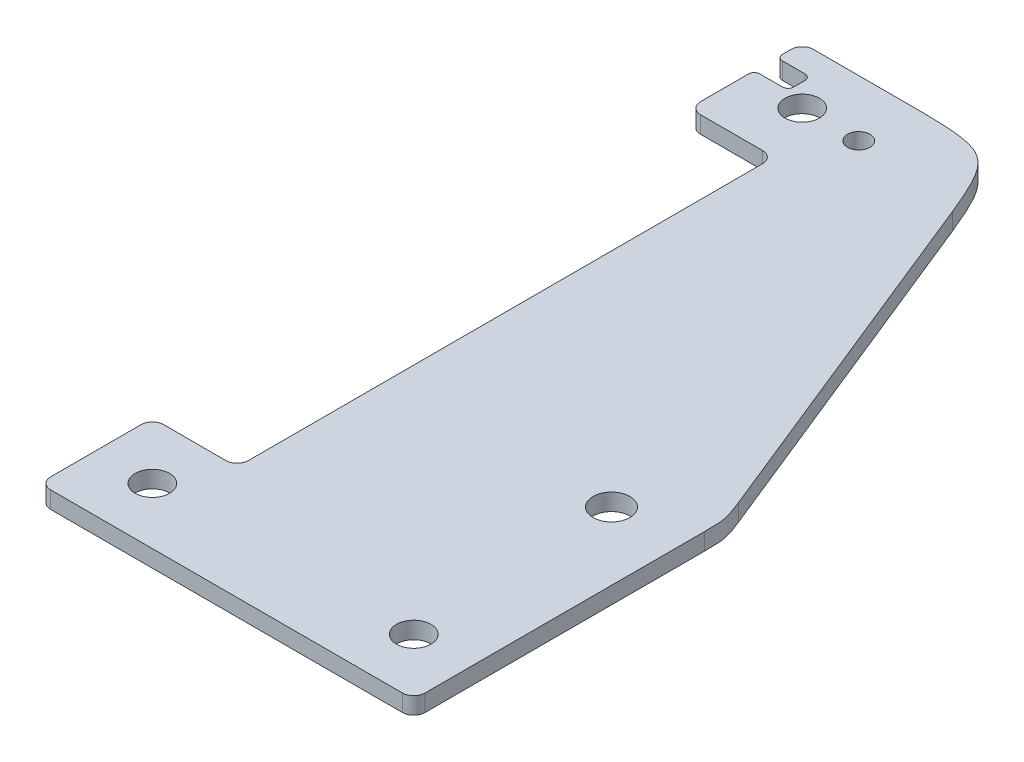
ISO-10303-21;
HEADER;
FILE_DESCRIPTION(('STEP AP214'),'2;1');
FILE_NAME('part.step','',(''),(''),'','','');
FILE_SCHEMA(('AUTOMOTIVE_DESIGN { 1 0 10303 214 1 1 1 1 }'));
ENDSEC;
DATA;
#1=APPLICATION_CONTEXT('core data for automotive mechanical design processes');
#2=APPLICATION_PROTOCOL_DEFINITION('international standard','automotive_design',2000,#1);
#3=PRODUCT_CONTEXT('',#1,'mechanical');
#4=PRODUCT('Part','Part','',(#3));
#5=PRODUCT_RELATED_PRODUCT_CATEGORY('part','',(#4));
#6=PRODUCT_DEFINITION_FORMATION('','',#4);
#7=PRODUCT_DEFINITION_CONTEXT('part definition',#1,'design');
#8=PRODUCT_DEFINITION('design','',#6,#7);
#9=PRODUCT_DEFINITION_SHAPE('','',#8);
#10=(LENGTH_UNIT() NAMED_UNIT(*) SI_UNIT(.MILLI.,.METRE.));
#11=(NAMED_UNIT(*) PLANE_ANGLE_UNIT() SI_UNIT($,.RADIAN.));
#12=(NAMED_UNIT(*) SI_UNIT($,.STERADIAN.) SOLID_ANGLE_UNIT());
#13=UNCERTAINTY_MEASURE_WITH_UNIT(LENGTH_MEASURE(1.E-05),#10,'distance_accuracy_value','');
#14=(GEOMETRIC_REPRESENTATION_CONTEXT(3) GLOBAL_UNCERTAINTY_ASSIGNED_CONTEXT((#13)) GLOBAL_UNIT_ASSIGNED_CONTEXT((#10,
#11,#12)) REPRESENTATION_CONTEXT('',''));
#15=CARTESIAN_POINT('',(0.,0.,0.));
#16=DIRECTION('',(0.,0.,1.));
#17=DIRECTION('',(1.,0.,0.));
#18=AXIS2_PLACEMENT_3D('',#15,#16,#17);
#19=CARTESIAN_POINT('',(0.,3.,0.));
#20=DIRECTION('',(0.,-1.,0.));
#21=DIRECTION('',(0.,0.,-1.));
#22=AXIS2_PLACEMENT_3D('',#19,#20,#21);
#23=PLANE('',#22);
#24=CARTESIAN_POINT('',(0.,3.,-57.5));
#25=DIRECTION('',(0.,1.,0.));
#26=DIRECTION('',(0.,0.,1.));
#27=AXIS2_PLACEMENT_3D('',#24,#25,#26);
#28=CIRCLE('',#27,2.);
#29=CARTESIAN_POINT('',(0.,3.,-55.5));
#30=VERTEX_POINT('',#29);
#31=EDGE_CURVE('E893',#30,#30,#28,.T.);
#32=ORIENTED_EDGE('',*,*,#31,.F.);
#33=EDGE_LOOP('',(#32));
#34=FACE_BOUND('',#33,.T.);
#35=CARTESIAN_POINT('',(34.25,3.,20.5));
#36=DIRECTION('',(0.,1.,0.));
#37=DIRECTION('',(-1.,0.,0.));
#38=AXIS2_PLACEMENT_3D('',#35,#36,#37);
#39=CIRCLE('',#38,3.25);
#40=CARTESIAN_POINT('',(31.,3.,20.5));
#41=VERTEX_POINT('',#40);
#42=EDGE_CURVE('E692',#41,#41,#39,.T.);
#43=ORIENTED_EDGE('',*,*,#42,.F.);
#44=EDGE_LOOP('',(#43));
#45=FACE_BOUND('',#44,.T.);
#46=CARTESIAN_POINT('',(36.25,3.,57.5));
#47=DIRECTION('',(0.,-1.,0.));
#48=DIRECTION('',(1.,0.,0.));
#49=AXIS2_PLACEMENT_3D('',#46,#47,#48);
#50=CIRCLE('',#49,3.05);
#51=CARTESIAN_POINT('',(39.3,3.,57.5));
#52=VERTEX_POINT('',#51);
#53=EDGE_CURVE('E498',#52,#52,#50,.T.);
#54=ORIENTED_EDGE('',*,*,#53,.T.);
#55=EDGE_LOOP('',(#54));
#56=FACE_BOUND('',#55,.T.);
#57=CARTESIAN_POINT('',(-10.,3.,-57.5));
#58=DIRECTION('',(0.,1.,0.));
#59=DIRECTION('',(1.,0.,0.));
#60=AXIS2_PLACEMENT_3D('',#57,#58,#59);
#61=CIRCLE('',#60,3.05);
#62=CARTESIAN_POINT('',(-6.95,3.,-57.5));
#63=VERTEX_POINT('',#62);
#64=EDGE_CURVE('E305',#63,#63,#61,.T.);
#65=ORIENTED_EDGE('',*,*,#64,.F.);
#66=EDGE_LOOP('',(#65));
#67=FACE_BOUND('',#66,.T.);
#68=CARTESIAN_POINT('',(-10.,3.,57.5));
#69=DIRECTION('',(0.,1.,0.));
#70=DIRECTION('',(1.,0.,0.));
#71=AXIS2_PLACEMENT_3D('',#68,#69,#70);
#72=CIRCLE('',#71,3.05);
#73=CARTESIAN_POINT('',(-6.95,3.,57.5));
#74=VERTEX_POINT('',#73);
#75=EDGE_CURVE('E321',#74,#74,#72,.T.);
#76=ORIENTED_EDGE('',*,*,#75,.F.);
#77=EDGE_LOOP('',(#76));
#78=FACE_BOUND('',#77,.T.);
#79=DIRECTION('',(0.374606593415918,0.,0.927183854566785));
#80=VECTOR('',#79,1.);
#81=CARTESIAN_POINT('',(35.5379010640419,3.,-14.3582440410083));
#82=LINE('',#81,#80);
#83=CARTESIAN_POINT('',(44.7936770913357,3.,8.55060552231191));
#84=VERTEX_POINT('',#83);
#85=CARTESIAN_POINT('',(19.1207447241643,3.,-54.9921318683184));
#86=VERTEX_POINT('',#85);
#87=EDGE_CURVE('E495',#84,#86,#82,.F.);
#88=ORIENTED_EDGE('',*,*,#87,.T.);
#89=CARTESIAN_POINT('',(0.577067632828641,3.,-67.5));
#90=CARTESIAN_POINT('',(14.0672379696771,3.,-67.5));
#91=CARTESIAN_POINT('',(19.1207447241643,3.,-54.9921318683184));
#92=(BOUNDED_CURVE() B_SPLINE_CURVE(2,(#89,#90,#91),.UNSPECIFIED.,.F.,
.F.) B_SPLINE_CURVE_WITH_KNOTS((3,3),(0.,1.),
.UNSPECIFIED.) CURVE() GEOMETRIC_REPRESENTATION_ITEM() RATIONAL_B_SPLINE_CURVE((1.,
2.33333333333333,1.)) REPRESENTATION_ITEM(''));
#93=CARTESIAN_POINT('',(0.577067632828641,3.,-67.5));
#94=VERTEX_POINT('',#93);
#95=EDGE_CURVE('E406',#86,#94,#92,.F.);
#96=ORIENTED_EDGE('',*,*,#95,.T.);
#97=DIRECTION('',(1.,0.,0.));
#98=VECTOR('',#97,1.);
#99=CARTESIAN_POINT('',(-20.,3.,-67.5));
#100=LINE('',#99,#98);
#101=CARTESIAN_POINT('',(-18.,3.,-67.5));
#102=VERTEX_POINT('',#101);
#103=EDGE_CURVE('E530',#102,#94,#100,.T.);
#104=ORIENTED_EDGE('',*,*,#103,.F.);
#105=CARTESIAN_POINT('',(-18.,3.,-65.5));
#106=DIRECTION('',(0.,1.,0.));
#107=DIRECTION('',(0.,0.,-1.));
#108=AXIS2_PLACEMENT_3D('',#105,#106,#107);
#109=CIRCLE('',#108,2.);
#110=CARTESIAN_POINT('',(-20.,3.,-65.5));
#111=VERTEX_POINT('',#110);
#112=EDGE_CURVE('E681',#102,#111,#109,.T.);
#113=ORIENTED_EDGE('',*,*,#112,.T.);
#114=DIRECTION('',(0.,0.,-1.));
#115=VECTOR('',#114,1.);
#116=CARTESIAN_POINT('',(-20.,3.,-47.5));
#117=LINE('',#116,#115);
#118=CARTESIAN_POINT('',(-20.,3.,-64.));
#119=VERTEX_POINT('',#118);
#120=EDGE_CURVE('E613',#119,#111,#117,.T.);
#121=ORIENTED_EDGE('',*,*,#120,.F.);
#122=CARTESIAN_POINT('',(-19.,3.,-64.));
#123=DIRECTION('',(0.,1.,0.));
#124=DIRECTION('',(-1.,0.,0.));
#125=AXIS2_PLACEMENT_3D('',#122,#123,#124);
#126=CIRCLE('',#125,1.);
#127=CARTESIAN_POINT('',(-19.,3.,-63.));
#128=VERTEX_POINT('',#127);
#129=EDGE_CURVE('E612',#119,#128,#126,.T.);
#130=ORIENTED_EDGE('',*,*,#129,.T.);
#131=DIRECTION('',(1.,0.,0.));
#132=VECTOR('',#131,1.);
#133=CARTESIAN_POINT('',(-19.,3.,-63.));
#134=LINE('',#133,#132);
#135=CARTESIAN_POINT('',(-15.,3.,-63.));
#136=VERTEX_POINT('',#135);
#137=EDGE_CURVE('E274',#128,#136,#134,.T.);
#138=ORIENTED_EDGE('',*,*,#137,.T.);
#139=CARTESIAN_POINT('',(-15.,3.,-62.));
#140=DIRECTION('',(0.,-1.,0.));
#141=DIRECTION('',(-1.,0.,0.));
#142=AXIS2_PLACEMENT_3D('',#139,#140,#141);
#143=CIRCLE('',#142,1.);
#144=CARTESIAN_POINT('',(-14.,3.,-62.));
#145=VERTEX_POINT('',#144);
#146=EDGE_CURVE('E268',#136,#145,#143,.T.);
#147=ORIENTED_EDGE('',*,*,#146,.T.);
#148=DIRECTION('',(0.,0.,1.));
#149=VECTOR('',#148,1.);
#150=CARTESIAN_POINT('',(-14.,3.,-62.));
#151=LINE('',#150,#149);
#152=CARTESIAN_POINT('',(-14.,3.,-60.));
#153=VERTEX_POINT('',#152);
#154=EDGE_CURVE('E258',#145,#153,#151,.T.);
#155=ORIENTED_EDGE('',*,*,#154,.T.);
#156=CARTESIAN_POINT('',(-15.,3.,-60.));
#157=DIRECTION('',(0.,-1.,0.));
#158=DIRECTION('',(-1.,0.,0.));
#159=AXIS2_PLACEMENT_3D('',#156,#157,#158);
#160=CIRCLE('',#159,1.);
#161=CARTESIAN_POINT('',(-15.,3.,-59.));
#162=VERTEX_POINT('',#161);
#163=EDGE_CURVE('E269',#153,#162,#160,.T.);
#164=ORIENTED_EDGE('',*,*,#163,.T.);
#165=DIRECTION('',(-1.,0.,0.));
#166=VECTOR('',#165,1.);
#167=CARTESIAN_POINT('',(-15.,3.,-59.));
#168=LINE('',#167,#166);
#169=CARTESIAN_POINT('',(-19.,3.,-59.));
#170=VERTEX_POINT('',#169);
#171=EDGE_CURVE('E630',#162,#170,#168,.T.);
#172=ORIENTED_EDGE('',*,*,#171,.T.);
#173=CARTESIAN_POINT('',(-19.,3.,-58.));
#174=DIRECTION('',(0.,1.,0.));
#175=DIRECTION('',(1.,0.,0.));
#176=AXIS2_PLACEMENT_3D('',#173,#174,#175);
#177=CIRCLE('',#176,1.);
#178=CARTESIAN_POINT('',(-20.,3.,-58.));
#179=VERTEX_POINT('',#178);
#180=EDGE_CURVE('E699',#170,#179,#177,.T.);
#181=ORIENTED_EDGE('',*,*,#180,.T.);
#182=DIRECTION('',(0.,0.,-1.));
#183=VECTOR('',#182,1.);
#184=CARTESIAN_POINT('',(-20.,3.,-47.5));
#185=LINE('',#184,#183);
#186=CARTESIAN_POINT('',(-20.,3.,-49.5));
#187=VERTEX_POINT('',#186);
#188=EDGE_CURVE('E533',#187,#179,#185,.T.);
#189=ORIENTED_EDGE('',*,*,#188,.F.);
#190=CARTESIAN_POINT('',(-18.,3.,-49.5));
#191=DIRECTION('',(0.,1.,0.));
#192=DIRECTION('',(0.,0.,-1.));
#193=AXIS2_PLACEMENT_3D('',#190,#191,#192);
#194=CIRCLE('',#193,2.);
#195=CARTESIAN_POINT('',(-18.,3.,-47.5));
#196=VERTEX_POINT('',#195);
#197=EDGE_CURVE('E736',#187,#196,#194,.T.);
#198=ORIENTED_EDGE('',*,*,#197,.T.);
#199=DIRECTION('',(-1.,0.,0.));
#200=VECTOR('',#199,1.);
#201=CARTESIAN_POINT('',(0.,3.,-47.5));
#202=LINE('',#201,#200);
#203=CARTESIAN_POINT('',(-7.,3.,-47.5));
#204=VERTEX_POINT('',#203);
#205=EDGE_CURVE('E760',#204,#196,#202,.T.);
#206=ORIENTED_EDGE('',*,*,#205,.F.);
#207=CARTESIAN_POINT('',(-7.,3.,-45.5));
#208=DIRECTION('',(0.,-1.,0.));
#209=DIRECTION('',(0.,0.,-1.));
#210=AXIS2_PLACEMENT_3D('',#207,#208,#209);
#211=CIRCLE('',#210,2.);
#212=CARTESIAN_POINT('',(-5.,3.,-45.5));
#213=VERTEX_POINT('',#212);
#214=EDGE_CURVE('E742',#204,#213,#211,.T.);
#215=ORIENTED_EDGE('',*,*,#214,.T.);
#216=DIRECTION('',(0.,0.,1.));
#217=VECTOR('',#216,1.);
#218=CARTESIAN_POINT('',(-5.,3.,-57.7596620908131));
#219=LINE('',#218,#217);
#220=CARTESIAN_POINT('',(-5.,3.,45.5));
#221=VERTEX_POINT('',#220);
#222=EDGE_CURVE('E801',#213,#221,#219,.T.);
#223=ORIENTED_EDGE('',*,*,#222,.T.);
#224=CARTESIAN_POINT('',(-7.,3.,45.5));
#225=DIRECTION('',(0.,-1.,0.));
#226=DIRECTION('',(0.,0.,-1.));
#227=AXIS2_PLACEMENT_3D('',#224,#225,#226);
#228=CIRCLE('',#227,2.);
#229=CARTESIAN_POINT('',(-7.,3.,47.5));
#230=VERTEX_POINT('',#229);
#231=EDGE_CURVE('E334',#221,#230,#228,.T.);
#232=ORIENTED_EDGE('',*,*,#231,.T.);
#233=DIRECTION('',(1.,0.,0.));
#234=VECTOR('',#233,1.);
#235=CARTESIAN_POINT('',(-20.,3.,47.5));
#236=LINE('',#235,#234);
#237=CARTESIAN_POINT('',(-18.,3.,47.5));
#238=VERTEX_POINT('',#237);
#239=EDGE_CURVE('E297',#238,#230,#236,.T.);
#240=ORIENTED_EDGE('',*,*,#239,.F.);
#241=CARTESIAN_POINT('',(-18.,3.,49.5));
#242=DIRECTION('',(0.,1.,0.));
#243=DIRECTION('',(0.,0.,-1.));
#244=AXIS2_PLACEMENT_3D('',#241,#242,#243);
#245=CIRCLE('',#244,2.);
#246=CARTESIAN_POINT('',(-20.,3.,49.5));
#247=VERTEX_POINT('',#246);
#248=EDGE_CURVE('E652',#238,#247,#245,.T.);
#249=ORIENTED_EDGE('',*,*,#248,.T.);
#250=DIRECTION('',(0.,0.,-1.));
#251=VECTOR('',#250,1.);
#252=CARTESIAN_POINT('',(-20.,3.,67.5));
#253=LINE('',#252,#251);
#254=CARTESIAN_POINT('',(-20.,3.,65.5));
#255=VERTEX_POINT('',#254);
#256=EDGE_CURVE('E510',#255,#247,#253,.T.);
#257=ORIENTED_EDGE('',*,*,#256,.F.);
#258=CARTESIAN_POINT('',(-18.,3.,65.5));
#259=DIRECTION('',(0.,1.,0.));
#260=DIRECTION('',(0.,0.,-1.));
#261=AXIS2_PLACEMENT_3D('',#258,#259,#260);
#262=CIRCLE('',#261,2.);
#263=CARTESIAN_POINT('',(-18.,3.,67.5));
#264=VERTEX_POINT('',#263);
#265=EDGE_CURVE('E647',#255,#264,#262,.T.);
#266=ORIENTED_EDGE('',*,*,#265,.T.);
#267=DIRECTION('',(-1.,0.,0.));
#268=VECTOR('',#267,1.);
#269=CARTESIAN_POINT('',(76.25,3.,67.5));
#270=LINE('',#269,#268);
#271=CARTESIAN_POINT('',(44.25,3.,67.5));
#272=VERTEX_POINT('',#271);
#273=EDGE_CURVE('E662',#272,#264,#270,.T.);
#274=ORIENTED_EDGE('',*,*,#273,.F.);
#275=CARTESIAN_POINT('',(44.25,3.,65.5));
#276=DIRECTION('',(0.,1.,0.));
#277=DIRECTION('',(0.,0.,-1.));
#278=AXIS2_PLACEMENT_3D('',#275,#276,#277);
#279=CIRCLE('',#278,2.);
#280=CARTESIAN_POINT('',(46.25,3.,65.5));
#281=VERTEX_POINT('',#280);
#282=EDGE_CURVE('E518',#272,#281,#279,.T.);
#283=ORIENTED_EDGE('',*,*,#282,.T.);
#284=DIRECTION('',(0.,0.,1.));
#285=VECTOR('',#284,1.);
#286=CARTESIAN_POINT('',(46.25,3.,67.5));
#287=LINE('',#286,#285);
#288=CARTESIAN_POINT('',(46.25,3.,16.0427373906303));
#289=VERTEX_POINT('',#288);
#290=EDGE_CURVE('E521',#289,#281,#287,.T.);
#291=ORIENTED_EDGE('',*,*,#290,.F.);
#292=CARTESIAN_POINT('',(44.7936770913357,3.,8.5506055223119));
#293=CARTESIAN_POINT('',(46.25,3.,12.1551312078758));
#294=CARTESIAN_POINT('',(46.25,3.,16.0427373906303));
#295=(BOUNDED_CURVE() B_SPLINE_CURVE(2,(#292,#293,#294),.UNSPECIFIED.,.F.,
.F.) B_SPLINE_CURVE_WITH_KNOTS((3,3),(0.,1.),
.UNSPECIFIED.) CURVE() GEOMETRIC_REPRESENTATION_ITEM() RATIONAL_B_SPLINE_CURVE((1.,
2.33333333333333,1.)) REPRESENTATION_ITEM(''));
#296=EDGE_CURVE('E462',#289,#84,#295,.F.);
#297=ORIENTED_EDGE('',*,*,#296,.T.);
#298=EDGE_LOOP('',(#88,#96,#104,#113,#121,#130,#138,#147,#155,#164,#172,#181,#189,#198,#206,
#215,#223,#232,#240,#249,#257,#266,#274,#283,#291,#297));
#299=FACE_BOUND('',#298,.T.);
#300=ADVANCED_FACE('F50',(#34,#45,#56,#67,#78,#299),#23,.F.);
#301=CARTESIAN_POINT('',(0.,0.,0.));
#302=DIRECTION('',(0.,-1.,0.));
#303=DIRECTION('',(0.,0.,-1.));
#304=AXIS2_PLACEMENT_3D('',#301,#302,#303);
#305=PLANE('',#304);
#306=DIRECTION('',(1.,0.,0.));
#307=VECTOR('',#306,1.);
#308=CARTESIAN_POINT('',(-20.,0.,-67.5));
#309=LINE('',#308,#307);
#310=CARTESIAN_POINT('',(-18.,0.,-67.5));
#311=VERTEX_POINT('',#310);
#312=CARTESIAN_POINT('',(0.577067632828641,0.,-67.5));
#313=VERTEX_POINT('',#312);
#314=EDGE_CURVE('E338',#311,#313,#309,.T.);
#315=ORIENTED_EDGE('',*,*,#314,.T.);
#316=CARTESIAN_POINT('',(19.1207447241643,0.,-54.9921318683184));
#317=CARTESIAN_POINT('',(14.0672379696771,0.,-67.5));
#318=CARTESIAN_POINT('',(0.577067632828641,0.,-67.5));
#319=(BOUNDED_CURVE() B_SPLINE_CURVE(2,(#316,#317,#318),.UNSPECIFIED.,.F.,
.F.) B_SPLINE_CURVE_WITH_KNOTS((3,3),(0.,1.),
.UNSPECIFIED.) CURVE() GEOMETRIC_REPRESENTATION_ITEM() RATIONAL_B_SPLINE_CURVE((1.,
2.33333333333333,1.)) REPRESENTATION_ITEM(''));
#320=CARTESIAN_POINT('',(19.1207447241643,0.,-54.9921318683184));
#321=VERTEX_POINT('',#320);
#322=EDGE_CURVE('E64',#313,#321,#319,.F.);
#323=ORIENTED_EDGE('',*,*,#322,.T.);
#324=DIRECTION('',(-0.374606593415918,0.,-0.927183854566785));
#325=VECTOR('',#324,1.);
#326=CARTESIAN_POINT('',(46.3893360364903,0.,12.5));
#327=LINE('',#326,#325);
#328=CARTESIAN_POINT('',(44.7936770913357,0.,8.5506055223119));
#329=VERTEX_POINT('',#328);
#330=EDGE_CURVE('E494',#321,#329,#327,.F.);
#331=ORIENTED_EDGE('',*,*,#330,.T.);
#332=CARTESIAN_POINT('',(46.25,0.,16.0427373906303));
#333=CARTESIAN_POINT('',(46.25,0.,12.1551312078758));
#334=CARTESIAN_POINT('',(44.7936770913357,0.,8.5506055223119));
#335=(BOUNDED_CURVE() B_SPLINE_CURVE(2,(#332,#333,#334),.UNSPECIFIED.,.F.,
.F.) B_SPLINE_CURVE_WITH_KNOTS((3,3),(0.,1.),
.UNSPECIFIED.) CURVE() GEOMETRIC_REPRESENTATION_ITEM() RATIONAL_B_SPLINE_CURVE((1.,
2.33333333333333,1.)) REPRESENTATION_ITEM(''));
#336=CARTESIAN_POINT('',(46.25,0.,16.0427373906303));
#337=VERTEX_POINT('',#336);
#338=EDGE_CURVE('E71',#329,#337,#335,.F.);
#339=ORIENTED_EDGE('',*,*,#338,.T.);
#340=DIRECTION('',(0.,0.,1.));
#341=VECTOR('',#340,1.);
#342=CARTESIAN_POINT('',(46.25,0.,67.5));
#343=LINE('',#342,#341);
#344=CARTESIAN_POINT('',(46.25,0.,65.5));
#345=VERTEX_POINT('',#344);
#346=EDGE_CURVE('E341',#337,#345,#343,.T.);
#347=ORIENTED_EDGE('',*,*,#346,.T.);
#348=CARTESIAN_POINT('',(44.25,0.,65.5));
#349=DIRECTION('',(0.,-1.,0.));
#350=DIRECTION('',(0.,0.,-1.));
#351=AXIS2_PLACEMENT_3D('',#348,#349,#350);
#352=CIRCLE('',#351,2.);
#353=CARTESIAN_POINT('',(44.25,0.,67.5));
#354=VERTEX_POINT('',#353);
#355=EDGE_CURVE('E511',#345,#354,#352,.T.);
#356=ORIENTED_EDGE('',*,*,#355,.T.);
#357=DIRECTION('',(-1.,0.,0.));
#358=VECTOR('',#357,1.);
#359=CARTESIAN_POINT('',(76.25,0.,67.5));
#360=LINE('',#359,#358);
#361=CARTESIAN_POINT('',(-18.,0.,67.5));
#362=VERTEX_POINT('',#361);
#363=EDGE_CURVE('E513',#354,#362,#360,.T.);
#364=ORIENTED_EDGE('',*,*,#363,.T.);
#365=CARTESIAN_POINT('',(-18.,0.,65.5));
#366=DIRECTION('',(0.,-1.,0.));
#367=DIRECTION('',(0.,0.,-1.));
#368=AXIS2_PLACEMENT_3D('',#365,#366,#367);
#369=CIRCLE('',#368,2.);
#370=CARTESIAN_POINT('',(-20.,0.,65.5));
#371=VERTEX_POINT('',#370);
#372=EDGE_CURVE('E713',#362,#371,#369,.T.);
#373=ORIENTED_EDGE('',*,*,#372,.T.);
#374=DIRECTION('',(0.,0.,-1.));
#375=VECTOR('',#374,1.);
#376=CARTESIAN_POINT('',(-20.,0.,67.5));
#377=LINE('',#376,#375);
#378=CARTESIAN_POINT('',(-20.,0.,49.5));
#379=VERTEX_POINT('',#378);
#380=EDGE_CURVE('E631',#371,#379,#377,.T.);
#381=ORIENTED_EDGE('',*,*,#380,.T.);
#382=CARTESIAN_POINT('',(-18.,0.,49.5));
#383=DIRECTION('',(0.,-1.,0.));
#384=DIRECTION('',(0.,0.,-1.));
#385=AXIS2_PLACEMENT_3D('',#382,#383,#384);
#386=CIRCLE('',#385,2.);
#387=CARTESIAN_POINT('',(-18.,0.,47.5));
#388=VERTEX_POINT('',#387);
#389=EDGE_CURVE('E671',#379,#388,#386,.T.);
#390=ORIENTED_EDGE('',*,*,#389,.T.);
#391=DIRECTION('',(1.,0.,0.));
#392=VECTOR('',#391,1.);
#393=CARTESIAN_POINT('',(-20.,0.,47.5));
#394=LINE('',#393,#392);
#395=CARTESIAN_POINT('',(-7.,0.,47.5));
#396=VERTEX_POINT('',#395);
#397=EDGE_CURVE('E757',#388,#396,#394,.T.);
#398=ORIENTED_EDGE('',*,*,#397,.T.);
#399=CARTESIAN_POINT('',(-7.,0.,45.5));
#400=DIRECTION('',(0.,1.,0.));
#401=DIRECTION('',(0.,0.,-1.));
#402=AXIS2_PLACEMENT_3D('',#399,#400,#401);
#403=CIRCLE('',#402,2.);
#404=CARTESIAN_POINT('',(-5.,0.,45.5));
#405=VERTEX_POINT('',#404);
#406=EDGE_CURVE('E331',#396,#405,#403,.T.);
#407=ORIENTED_EDGE('',*,*,#406,.T.);
#408=DIRECTION('',(0.,0.,1.));
#409=VECTOR('',#408,1.);
#410=CARTESIAN_POINT('',(-5.,0.,-57.7596620908131));
#411=LINE('',#410,#409);
#412=CARTESIAN_POINT('',(-5.,0.,-45.5));
#413=VERTEX_POINT('',#412);
#414=EDGE_CURVE('E622',#413,#405,#411,.T.);
#415=ORIENTED_EDGE('',*,*,#414,.F.);
#416=CARTESIAN_POINT('',(-7.,0.,-45.5));
#417=DIRECTION('',(0.,1.,0.));
#418=DIRECTION('',(0.,0.,-1.));
#419=AXIS2_PLACEMENT_3D('',#416,#417,#418);
#420=CIRCLE('',#419,2.);
#421=CARTESIAN_POINT('',(-7.,0.,-47.5));
#422=VERTEX_POINT('',#421);
#423=EDGE_CURVE('E303',#413,#422,#420,.T.);
#424=ORIENTED_EDGE('',*,*,#423,.T.);
#425=DIRECTION('',(-1.,0.,0.));
#426=VECTOR('',#425,1.);
#427=CARTESIAN_POINT('',(0.,0.,-47.5));
#428=LINE('',#427,#426);
#429=CARTESIAN_POINT('',(-18.,0.,-47.5));
#430=VERTEX_POINT('',#429);
#431=EDGE_CURVE('E299',#422,#430,#428,.T.);
#432=ORIENTED_EDGE('',*,*,#431,.T.);
#433=CARTESIAN_POINT('',(-18.,0.,-49.5));
#434=DIRECTION('',(0.,-1.,0.));
#435=DIRECTION('',(0.,0.,-1.));
#436=AXIS2_PLACEMENT_3D('',#433,#434,#435);
#437=CIRCLE('',#436,2.);
#438=CARTESIAN_POINT('',(-20.,0.,-49.5));
#439=VERTEX_POINT('',#438);
#440=EDGE_CURVE('E304',#430,#439,#437,.T.);
#441=ORIENTED_EDGE('',*,*,#440,.T.);
#442=DIRECTION('',(0.,0.,-1.));
#443=VECTOR('',#442,1.);
#444=CARTESIAN_POINT('',(-20.,0.,-47.5));
#445=LINE('',#444,#443);
#446=CARTESIAN_POINT('',(-20.,-1.11022302462516E-13,-58.));
#447=VERTEX_POINT('',#446);
#448=EDGE_CURVE('E782',#439,#447,#445,.T.);
#449=ORIENTED_EDGE('',*,*,#448,.T.);
#450=CARTESIAN_POINT('',(-19.,0.,-58.));
#451=DIRECTION('',(0.,-1.,0.));
#452=DIRECTION('',(0.,0.,-1.));
#453=AXIS2_PLACEMENT_3D('',#450,#451,#452);
#454=CIRCLE('',#453,1.);
#455=CARTESIAN_POINT('',(-19.,0.,-59.));
#456=VERTEX_POINT('',#455);
#457=EDGE_CURVE('E784',#447,#456,#454,.T.);
#458=ORIENTED_EDGE('',*,*,#457,.T.);
#459=DIRECTION('',(1.,0.,0.));
#460=VECTOR('',#459,1.);
#461=CARTESIAN_POINT('',(-1.02348685082632E-13,0.,-59.));
#462=LINE('',#461,#460);
#463=CARTESIAN_POINT('',(-15.,0.,-59.));
#464=VERTEX_POINT('',#463);
#465=EDGE_CURVE('E685',#456,#464,#462,.T.);
#466=ORIENTED_EDGE('',*,*,#465,.T.);
#467=CARTESIAN_POINT('',(-15.,0.,-60.));
#468=DIRECTION('',(0.,1.,0.));
#469=DIRECTION('',(0.,0.,-1.));
#470=AXIS2_PLACEMENT_3D('',#467,#468,#469);
#471=CIRCLE('',#470,1.);
#472=CARTESIAN_POINT('',(-14.,0.,-60.));
#473=VERTEX_POINT('',#472);
#474=EDGE_CURVE('E682',#464,#473,#471,.T.);
#475=ORIENTED_EDGE('',*,*,#474,.T.);
#476=DIRECTION('',(0.,0.,-1.));
#477=VECTOR('',#476,1.);
#478=CARTESIAN_POINT('',(-14.,0.,0.));
#479=LINE('',#478,#477);
#480=CARTESIAN_POINT('',(-14.,0.,-62.));
#481=VERTEX_POINT('',#480);
#482=EDGE_CURVE('E625',#473,#481,#479,.T.);
#483=ORIENTED_EDGE('',*,*,#482,.T.);
#484=CARTESIAN_POINT('',(-15.,0.,-62.));
#485=DIRECTION('',(0.,1.,0.));
#486=DIRECTION('',(0.,0.,-1.));
#487=AXIS2_PLACEMENT_3D('',#484,#485,#486);
#488=CIRCLE('',#487,1.);
#489=CARTESIAN_POINT('',(-15.,0.,-63.));
#490=VERTEX_POINT('',#489);
#491=EDGE_CURVE('E282',#481,#490,#488,.T.);
#492=ORIENTED_EDGE('',*,*,#491,.T.);
#493=DIRECTION('',(-1.,0.,0.));
#494=VECTOR('',#493,1.);
#495=CARTESIAN_POINT('',(0.,0.,-63.));
#496=LINE('',#495,#494);
#497=CARTESIAN_POINT('',(-19.,0.,-63.));
#498=VERTEX_POINT('',#497);
#499=EDGE_CURVE('E607',#490,#498,#496,.T.);
#500=ORIENTED_EDGE('',*,*,#499,.T.);
#501=CARTESIAN_POINT('',(-19.,0.,-64.));
#502=DIRECTION('',(0.,-1.,0.));
#503=DIRECTION('',(0.,0.,-1.));
#504=AXIS2_PLACEMENT_3D('',#501,#502,#503);
#505=CIRCLE('',#504,1.);
#506=CARTESIAN_POINT('',(-20.,-1.11022302462516E-13,-64.));
#507=VERTEX_POINT('',#506);
#508=EDGE_CURVE('E603',#498,#507,#505,.T.);
#509=ORIENTED_EDGE('',*,*,#508,.T.);
#510=DIRECTION('',(0.,0.,-1.));
#511=VECTOR('',#510,1.);
#512=CARTESIAN_POINT('',(-20.,0.,-47.5));
#513=LINE('',#512,#511);
#514=CARTESIAN_POINT('',(-20.,0.,-65.5));
#515=VERTEX_POINT('',#514);
#516=EDGE_CURVE('E596',#507,#515,#513,.T.);
#517=ORIENTED_EDGE('',*,*,#516,.T.);
#518=CARTESIAN_POINT('',(-18.,0.,-65.5));
#519=DIRECTION('',(0.,-1.,0.));
#520=DIRECTION('',(0.,0.,-1.));
#521=AXIS2_PLACEMENT_3D('',#518,#519,#520);
#522=CIRCLE('',#521,2.);
#523=EDGE_CURVE('E340',#515,#311,#522,.T.);
#524=ORIENTED_EDGE('',*,*,#523,.T.);
#525=EDGE_LOOP('',(#315,#323,#331,#339,#347,#356,#364,#373,#381,#390,#398,#407,#415,#424,#432,
#441,#449,#458,#466,#475,#483,#492,#500,#509,#517,#524));
#526=FACE_BOUND('',#525,.T.);
#527=CARTESIAN_POINT('',(0.,-1.11022302462516E-13,-57.5));
#528=DIRECTION('',(0.,1.,0.));
#529=DIRECTION('',(0.,0.,1.));
#530=AXIS2_PLACEMENT_3D('',#527,#528,#529);
#531=CIRCLE('',#530,2.);
#532=CARTESIAN_POINT('',(0.,-1.11022302462516E-13,-55.5));
#533=VERTEX_POINT('',#532);
#534=EDGE_CURVE('E696',#533,#533,#531,.T.);
#535=ORIENTED_EDGE('',*,*,#534,.T.);
#536=EDGE_LOOP('',(#535));
#537=FACE_BOUND('',#536,.T.);
#538=CARTESIAN_POINT('',(34.25,0.,20.5));
#539=DIRECTION('',(0.,-1.,0.));
#540=DIRECTION('',(0.,0.,-1.));
#541=AXIS2_PLACEMENT_3D('',#538,#539,#540);
#542=CIRCLE('',#541,3.25);
#543=CARTESIAN_POINT('',(34.25,0.,17.25));
#544=VERTEX_POINT('',#543);
#545=EDGE_CURVE('E288',#544,#544,#542,.T.);
#546=ORIENTED_EDGE('',*,*,#545,.F.);
#547=EDGE_LOOP('',(#546));
#548=FACE_BOUND('',#547,.T.);
#549=CARTESIAN_POINT('',(-10.,0.,57.5));
#550=DIRECTION('',(0.,1.,0.));
#551=DIRECTION('',(1.,0.,0.));
#552=AXIS2_PLACEMENT_3D('',#549,#550,#551);
#553=CIRCLE('',#552,3.05);
#554=CARTESIAN_POINT('',(-6.95,0.,57.5));
#555=VERTEX_POINT('',#554);
#556=EDGE_CURVE('E644',#555,#555,#553,.T.);
#557=ORIENTED_EDGE('',*,*,#556,.T.);
#558=EDGE_LOOP('',(#557));
#559=FACE_BOUND('',#558,.T.);
#560=CARTESIAN_POINT('',(-10.,0.,-57.5));
#561=DIRECTION('',(0.,1.,0.));
#562=DIRECTION('',(1.,0.,0.));
#563=AXIS2_PLACEMENT_3D('',#560,#561,#562);
#564=CIRCLE('',#563,3.05);
#565=CARTESIAN_POINT('',(-6.95,0.,-57.5));
#566=VERTEX_POINT('',#565);
#567=EDGE_CURVE('E779',#566,#566,#564,.T.);
#568=ORIENTED_EDGE('',*,*,#567,.T.);
#569=EDGE_LOOP('',(#568));
#570=FACE_BOUND('',#569,.T.);
#571=CARTESIAN_POINT('',(36.25,0.,57.5));
#572=DIRECTION('',(0.,-1.,0.));
#573=DIRECTION('',(1.,0.,0.));
#574=AXIS2_PLACEMENT_3D('',#571,#572,#573);
#575=CIRCLE('',#574,3.05);
#576=CARTESIAN_POINT('',(39.3,0.,57.5));
#577=VERTEX_POINT('',#576);
#578=EDGE_CURVE('E309',#577,#577,#575,.T.);
#579=ORIENTED_EDGE('',*,*,#578,.F.);
#580=EDGE_LOOP('',(#579));
#581=FACE_BOUND('',#580,.T.);
#582=ADVANCED_FACE('F547',(#526,#537,#548,#559,#570,#581),#305,.T.);
#583=CARTESIAN_POINT('',(-20.,3.,-47.5));
#584=DIRECTION('',(-1.,0.,0.));
#585=DIRECTION('',(0.,0.,1.));
#586=AXIS2_PLACEMENT_3D('',#583,#584,#585);
#587=PLANE('',#586);
#588=ORIENTED_EDGE('',*,*,#516,.F.);
#589=DIRECTION('',(0.,1.,0.));
#590=VECTOR('',#589,1.);
#591=CARTESIAN_POINT('',(-20.,-177.,-64.));
#592=LINE('',#591,#590);
#593=EDGE_CURVE('E599',#507,#119,#592,.T.);
#594=ORIENTED_EDGE('',*,*,#593,.T.);
#595=ORIENTED_EDGE('',*,*,#120,.T.);
#596=DIRECTION('',(0.,-1.,0.));
#597=VECTOR('',#596,1.);
#598=CARTESIAN_POINT('',(-20.,3.,-65.5));
#599=LINE('',#598,#597);
#600=EDGE_CURVE('E601',#111,#515,#599,.T.);
#601=ORIENTED_EDGE('',*,*,#600,.T.);
#602=EDGE_LOOP('',(#588,#594,#595,#601));
#603=FACE_BOUND('',#602,.T.);
#604=ADVANCED_FACE('F583',(#603),#587,.T.);
#605=CARTESIAN_POINT('',(-20.,3.,-47.5));
#606=DIRECTION('',(-1.,0.,0.));
#607=DIRECTION('',(0.,0.,1.));
#608=AXIS2_PLACEMENT_3D('',#605,#606,#607);
#609=PLANE('',#608);
#610=DIRECTION('',(0.,1.,0.));
#611=VECTOR('',#610,1.);
#612=CARTESIAN_POINT('',(-20.,-177.,-58.));
#613=LINE('',#612,#611);
#614=EDGE_CURVE('E327',#447,#179,#613,.T.);
#615=ORIENTED_EDGE('',*,*,#614,.F.);
#616=ORIENTED_EDGE('',*,*,#448,.F.);
#617=DIRECTION('',(0.,1.,0.));
#618=VECTOR('',#617,1.);
#619=CARTESIAN_POINT('',(-20.,3.,-49.5));
#620=LINE('',#619,#618);
#621=EDGE_CURVE('E686',#439,#187,#620,.T.);
#622=ORIENTED_EDGE('',*,*,#621,.T.);
#623=ORIENTED_EDGE('',*,*,#188,.T.);
#624=EDGE_LOOP('',(#615,#616,#622,#623));
#625=FACE_BOUND('',#624,.T.);
#626=ADVANCED_FACE('F363',(#625),#609,.T.);
#627=CARTESIAN_POINT('',(-20.,3.,-67.5));
#628=DIRECTION('',(0.,0.,-1.));
#629=DIRECTION('',(0.,-1.,0.));
#630=AXIS2_PLACEMENT_3D('',#627,#628,#629);
#631=PLANE('',#630);
#632=ORIENTED_EDGE('',*,*,#103,.T.);
#633=CARTESIAN_POINT('',(0.577067632828641,-0.15,-67.5));
#634=CARTESIAN_POINT('',(0.577067632828641,0.949999999999999,-67.5));
#635=CARTESIAN_POINT('',(0.577067632828641,2.05,-67.5));
#636=CARTESIAN_POINT('',(0.577067632828641,3.15,-67.5));
#637=(BOUNDED_CURVE() B_SPLINE_CURVE(3,(#633,#634,#635,#636),.UNSPECIFIED.,.F.,
.F.) B_SPLINE_CURVE_WITH_KNOTS((4,4),(-0.000149999999999889,0.00315000000000011),
.UNSPECIFIED.) CURVE() GEOMETRIC_REPRESENTATION_ITEM() RATIONAL_B_SPLINE_CURVE((1.,1.,1.,1.)) REPRESENTATION_ITEM(''));
#638=EDGE_CURVE('E80',#94,#313,#637,.F.);
#639=ORIENTED_EDGE('',*,*,#638,.T.);
#640=ORIENTED_EDGE('',*,*,#314,.F.);
#641=DIRECTION('',(0.,1.,0.));
#642=VECTOR('',#641,1.);
#643=CARTESIAN_POINT('',(-18.,3.,-67.5));
#644=LINE('',#643,#642);
#645=EDGE_CURVE('E525',#311,#102,#644,.T.);
#646=ORIENTED_EDGE('',*,*,#645,.T.);
#647=EDGE_LOOP('',(#632,#639,#640,#646));
#648=FACE_BOUND('',#647,.T.);
#649=ADVANCED_FACE('F352',(#648),#631,.T.);
#650=CARTESIAN_POINT('',(46.25,3.,67.5));
#651=DIRECTION('',(1.,0.,0.));
#652=DIRECTION('',(0.,0.,1.));
#653=AXIS2_PLACEMENT_3D('',#650,#651,#652);
#654=PLANE('',#653);
#655=ORIENTED_EDGE('',*,*,#346,.F.);
#656=CARTESIAN_POINT('',(46.25,3.15,16.0427373906303));
#657=CARTESIAN_POINT('',(46.25,2.05,16.0427373906303));
#658=CARTESIAN_POINT('',(46.25,0.950000000000001,16.0427373906303));
#659=CARTESIAN_POINT('',(46.25,-0.15,16.0427373906303));
#660=(BOUNDED_CURVE() B_SPLINE_CURVE(3,(#656,#657,#658,#659),.UNSPECIFIED.,.F.,
.F.) B_SPLINE_CURVE_WITH_KNOTS((4,4),(-0.00315,0.00015),
.UNSPECIFIED.) CURVE() GEOMETRIC_REPRESENTATION_ITEM() RATIONAL_B_SPLINE_CURVE((1.,1.,1.,1.)) REPRESENTATION_ITEM(''));
#661=EDGE_CURVE('E13',#337,#289,#660,.F.);
#662=ORIENTED_EDGE('',*,*,#661,.T.);
#663=ORIENTED_EDGE('',*,*,#290,.T.);
#664=DIRECTION('',(0.,-1.,0.));
#665=VECTOR('',#664,1.);
#666=CARTESIAN_POINT('',(46.25,3.,65.5));
#667=LINE('',#666,#665);
#668=EDGE_CURVE('E526',#281,#345,#667,.T.);
#669=ORIENTED_EDGE('',*,*,#668,.T.);
#670=EDGE_LOOP('',(#655,#662,#663,#669));
#671=FACE_BOUND('',#670,.T.);
#672=ADVANCED_FACE('F362',(#671),#654,.T.);
#673=CARTESIAN_POINT('',(76.25,3.,67.5));
#674=DIRECTION('',(0.,0.,1.));
#675=DIRECTION('',(1.,0.,0.));
#676=AXIS2_PLACEMENT_3D('',#673,#674,#675);
#677=PLANE('',#676);
#678=ORIENTED_EDGE('',*,*,#273,.T.);
#679=DIRECTION('',(0.,-1.,0.));
#680=VECTOR('',#679,1.);
#681=CARTESIAN_POINT('',(-18.,3.,67.5));
#682=LINE('',#681,#680);
#683=EDGE_CURVE('E509',#264,#362,#682,.T.);
#684=ORIENTED_EDGE('',*,*,#683,.T.);
#685=ORIENTED_EDGE('',*,*,#363,.F.);
#686=DIRECTION('',(0.,1.,0.));
#687=VECTOR('',#686,1.);
#688=CARTESIAN_POINT('',(44.25,3.,67.5));
#689=LINE('',#688,#687);
#690=EDGE_CURVE('E506',#354,#272,#689,.T.);
#691=ORIENTED_EDGE('',*,*,#690,.T.);
#692=EDGE_LOOP('',(#678,#684,#685,#691));
#693=FACE_BOUND('',#692,.T.);
#694=ADVANCED_FACE('F389',(#693),#677,.T.);
#695=CARTESIAN_POINT('',(-20.,3.,67.5));
#696=DIRECTION('',(-1.,0.,0.));
#697=DIRECTION('',(0.,0.,1.));
#698=AXIS2_PLACEMENT_3D('',#695,#696,#697);
#699=PLANE('',#698);
#700=ORIENTED_EDGE('',*,*,#256,.T.);
#701=DIRECTION('',(0.,-1.,0.));
#702=VECTOR('',#701,1.);
#703=CARTESIAN_POINT('',(-20.,3.,49.5));
#704=LINE('',#703,#702);
#705=EDGE_CURVE('E743',#247,#379,#704,.T.);
#706=ORIENTED_EDGE('',*,*,#705,.T.);
#707=ORIENTED_EDGE('',*,*,#380,.F.);
#708=DIRECTION('',(0.,1.,0.));
#709=VECTOR('',#708,1.);
#710=CARTESIAN_POINT('',(-20.,3.,65.5));
#711=LINE('',#710,#709);
#712=EDGE_CURVE('E752',#371,#255,#711,.T.);
#713=ORIENTED_EDGE('',*,*,#712,.T.);
#714=EDGE_LOOP('',(#700,#706,#707,#713));
#715=FACE_BOUND('',#714,.T.);
#716=ADVANCED_FACE('F561',(#715),#699,.T.);
#717=CARTESIAN_POINT('',(-20.,3.,47.5));
#718=DIRECTION('',(0.,0.,-1.));
#719=DIRECTION('',(0.,-1.,0.));
#720=AXIS2_PLACEMENT_3D('',#717,#718,#719);
#721=PLANE('',#720);
#722=ORIENTED_EDGE('',*,*,#239,.T.);
#723=DIRECTION('',(0.,-1.,0.));
#724=VECTOR('',#723,1.);
#725=CARTESIAN_POINT('',(-7.,0.,47.5));
#726=LINE('',#725,#724);
#727=EDGE_CURVE('E294',#230,#396,#726,.T.);
#728=ORIENTED_EDGE('',*,*,#727,.T.);
#729=ORIENTED_EDGE('',*,*,#397,.F.);
#730=DIRECTION('',(0.,1.,0.));
#731=VECTOR('',#730,1.);
#732=CARTESIAN_POINT('',(-18.,3.,47.5));
#733=LINE('',#732,#731);
#734=EDGE_CURVE('E298',#388,#238,#733,.T.);
#735=ORIENTED_EDGE('',*,*,#734,.T.);
#736=EDGE_LOOP('',(#722,#728,#729,#735));
#737=FACE_BOUND('',#736,.T.);
#738=ADVANCED_FACE('F364',(#737),#721,.T.);
#739=CARTESIAN_POINT('',(-10.,3.,57.5));
#740=DIRECTION('',(0.,-1.,0.));
#741=DIRECTION('',(0.,0.,-1.));
#742=AXIS2_PLACEMENT_3D('',#739,#740,#741);
#743=CYLINDRICAL_SURFACE('',#742,3.05);
#744=ORIENTED_EDGE('',*,*,#75,.T.);
#745=EDGE_LOOP('',(#744));
#746=FACE_BOUND('',#745,.T.);
#747=ORIENTED_EDGE('',*,*,#556,.F.);
#748=EDGE_LOOP('',(#747));
#749=FACE_BOUND('',#748,.T.);
#750=ADVANCED_FACE('F555',(#746,#749),#743,.F.);
#751=CARTESIAN_POINT('',(0.,3.,-47.5));
#752=DIRECTION('',(0.,0.,1.));
#753=DIRECTION('',(1.,0.,0.));
#754=AXIS2_PLACEMENT_3D('',#751,#752,#753);
#755=PLANE('',#754);
#756=ORIENTED_EDGE('',*,*,#431,.F.);
#757=DIRECTION('',(0.,1.,0.));
#758=VECTOR('',#757,1.);
#759=CARTESIAN_POINT('',(-7.,3.,-47.5));
#760=LINE('',#759,#758);
#761=EDGE_CURVE('E326',#422,#204,#760,.T.);
#762=ORIENTED_EDGE('',*,*,#761,.T.);
#763=ORIENTED_EDGE('',*,*,#205,.T.);
#764=DIRECTION('',(0.,-1.,0.));
#765=VECTOR('',#764,1.);
#766=CARTESIAN_POINT('',(-18.,3.,-47.5));
#767=LINE('',#766,#765);
#768=EDGE_CURVE('E292',#196,#430,#767,.T.);
#769=ORIENTED_EDGE('',*,*,#768,.T.);
#770=EDGE_LOOP('',(#756,#762,#763,#769));
#771=FACE_BOUND('',#770,.T.);
#772=ADVANCED_FACE('F550',(#771),#755,.T.);
#773=CARTESIAN_POINT('',(-10.,3.,-57.5));
#774=DIRECTION('',(0.,-1.,0.));
#775=DIRECTION('',(0.,0.,-1.));
#776=AXIS2_PLACEMENT_3D('',#773,#774,#775);
#777=CYLINDRICAL_SURFACE('',#776,3.05);
#778=ORIENTED_EDGE('',*,*,#64,.T.);
#779=EDGE_LOOP('',(#778));
#780=FACE_BOUND('',#779,.T.);
#781=ORIENTED_EDGE('',*,*,#567,.F.);
#782=EDGE_LOOP('',(#781));
#783=FACE_BOUND('',#782,.T.);
#784=ADVANCED_FACE('F554',(#780,#783),#777,.F.);
#785=CARTESIAN_POINT('',(36.25,3.,57.5));
#786=DIRECTION('',(0.,-1.,0.));
#787=DIRECTION('',(0.,0.,-1.));
#788=AXIS2_PLACEMENT_3D('',#785,#786,#787);
#789=CYLINDRICAL_SURFACE('',#788,3.05);
#790=ORIENTED_EDGE('',*,*,#53,.F.);
#791=EDGE_LOOP('',(#790));
#792=FACE_BOUND('',#791,.T.);
#793=ORIENTED_EDGE('',*,*,#578,.T.);
#794=EDGE_LOOP('',(#793));
#795=FACE_BOUND('',#794,.T.);
#796=ADVANCED_FACE('F384',(#792,#795),#789,.F.);
#797=CARTESIAN_POINT('',(44.25,3.,65.5));
#798=DIRECTION('',(0.,-1.,0.));
#799=DIRECTION('',(0.,0.,-1.));
#800=AXIS2_PLACEMENT_3D('',#797,#798,#799);
#801=CYLINDRICAL_SURFACE('',#800,2.);
#802=ORIENTED_EDGE('',*,*,#282,.F.);
#803=ORIENTED_EDGE('',*,*,#690,.F.);
#804=ORIENTED_EDGE('',*,*,#355,.F.);
#805=ORIENTED_EDGE('',*,*,#668,.F.);
#806=EDGE_LOOP('',(#802,#803,#804,#805));
#807=FACE_BOUND('',#806,.T.);
#808=ADVANCED_FACE('F380',(#807),#801,.T.);
#809=CARTESIAN_POINT('',(-18.,3.,-65.5));
#810=DIRECTION('',(0.,-1.,0.));
#811=DIRECTION('',(0.,0.,-1.));
#812=AXIS2_PLACEMENT_3D('',#809,#810,#811);
#813=CYLINDRICAL_SURFACE('',#812,2.);
#814=ORIENTED_EDGE('',*,*,#112,.F.);
#815=ORIENTED_EDGE('',*,*,#645,.F.);
#816=ORIENTED_EDGE('',*,*,#523,.F.);
#817=ORIENTED_EDGE('',*,*,#600,.F.);
#818=EDGE_LOOP('',(#814,#815,#816,#817));
#819=FACE_BOUND('',#818,.T.);
#820=ADVANCED_FACE('F376',(#819),#813,.T.);
#821=CARTESIAN_POINT('',(-18.,3.,-49.5));
#822=DIRECTION('',(0.,-1.,0.));
#823=DIRECTION('',(0.,0.,-1.));
#824=AXIS2_PLACEMENT_3D('',#821,#822,#823);
#825=CYLINDRICAL_SURFACE('',#824,2.);
#826=ORIENTED_EDGE('',*,*,#197,.F.);
#827=ORIENTED_EDGE('',*,*,#621,.F.);
#828=ORIENTED_EDGE('',*,*,#440,.F.);
#829=ORIENTED_EDGE('',*,*,#768,.F.);
#830=EDGE_LOOP('',(#826,#827,#828,#829));
#831=FACE_BOUND('',#830,.T.);
#832=ADVANCED_FACE('F379',(#831),#825,.T.);
#833=CARTESIAN_POINT('',(-18.,3.,65.5));
#834=DIRECTION('',(0.,-1.,0.));
#835=DIRECTION('',(0.,0.,-1.));
#836=AXIS2_PLACEMENT_3D('',#833,#834,#835);
#837=CYLINDRICAL_SURFACE('',#836,2.);
#838=ORIENTED_EDGE('',*,*,#265,.F.);
#839=ORIENTED_EDGE('',*,*,#712,.F.);
#840=ORIENTED_EDGE('',*,*,#372,.F.);
#841=ORIENTED_EDGE('',*,*,#683,.F.);
#842=EDGE_LOOP('',(#838,#839,#840,#841));
#843=FACE_BOUND('',#842,.T.);
#844=ADVANCED_FACE('F573',(#843),#837,.T.);
#845=CARTESIAN_POINT('',(-18.,3.,49.5));
#846=DIRECTION('',(0.,-1.,0.));
#847=DIRECTION('',(0.,0.,-1.));
#848=AXIS2_PLACEMENT_3D('',#845,#846,#847);
#849=CYLINDRICAL_SURFACE('',#848,2.);
#850=ORIENTED_EDGE('',*,*,#248,.F.);
#851=ORIENTED_EDGE('',*,*,#734,.F.);
#852=ORIENTED_EDGE('',*,*,#389,.F.);
#853=ORIENTED_EDGE('',*,*,#705,.F.);
#854=EDGE_LOOP('',(#850,#851,#852,#853));
#855=FACE_BOUND('',#854,.T.);
#856=ADVANCED_FACE('F952',(#855),#849,.T.);
#857=CARTESIAN_POINT('',(-5.,0.,-57.7596620908131));
#858=DIRECTION('',(-1.,0.,0.));
#859=DIRECTION('',(0.,0.,1.));
#860=AXIS2_PLACEMENT_3D('',#857,#858,#859);
#861=PLANE('',#860);
#862=ORIENTED_EDGE('',*,*,#222,.F.);
#863=DIRECTION('',(0.,-1.,0.));
#864=VECTOR('',#863,1.);
#865=CARTESIAN_POINT('',(-5.,0.,-45.5));
#866=LINE('',#865,#864);
#867=EDGE_CURVE('E702',#213,#413,#866,.T.);
#868=ORIENTED_EDGE('',*,*,#867,.T.);
#869=ORIENTED_EDGE('',*,*,#414,.T.);
#870=DIRECTION('',(0.,1.,0.));
#871=VECTOR('',#870,1.);
#872=CARTESIAN_POINT('',(-5.,3.,45.5));
#873=LINE('',#872,#871);
#874=EDGE_CURVE('E620',#405,#221,#873,.T.);
#875=ORIENTED_EDGE('',*,*,#874,.T.);
#876=EDGE_LOOP('',(#862,#868,#869,#875));
#877=FACE_BOUND('',#876,.T.);
#878=ADVANCED_FACE('F960',(#877),#861,.T.);
#879=CARTESIAN_POINT('',(-7.,0.,45.5));
#880=DIRECTION('',(0.,-1.,0.));
#881=DIRECTION('',(0.,0.,-1.));
#882=AXIS2_PLACEMENT_3D('',#879,#880,#881);
#883=CYLINDRICAL_SURFACE('',#882,2.);
#884=ORIENTED_EDGE('',*,*,#406,.F.);
#885=ORIENTED_EDGE('',*,*,#727,.F.);
#886=ORIENTED_EDGE('',*,*,#231,.F.);
#887=ORIENTED_EDGE('',*,*,#874,.F.);
#888=EDGE_LOOP('',(#884,#885,#886,#887));
#889=FACE_BOUND('',#888,.T.);
#890=ADVANCED_FACE('F968',(#889),#883,.F.);
#891=CARTESIAN_POINT('',(-7.,0.,-45.5));
#892=DIRECTION('',(0.,1.,0.));
#893=DIRECTION('',(0.,0.,1.));
#894=AXIS2_PLACEMENT_3D('',#891,#892,#893);
#895=CYLINDRICAL_SURFACE('',#894,2.);
#896=ORIENTED_EDGE('',*,*,#214,.F.);
#897=ORIENTED_EDGE('',*,*,#761,.F.);
#898=ORIENTED_EDGE('',*,*,#423,.F.);
#899=ORIENTED_EDGE('',*,*,#867,.F.);
#900=EDGE_LOOP('',(#896,#897,#898,#899));
#901=FACE_BOUND('',#900,.T.);
#902=ADVANCED_FACE('F577',(#901),#895,.F.);
#903=CARTESIAN_POINT('',(-15.,-177.,-60.));
#904=DIRECTION('',(0.,1.,0.));
#905=DIRECTION('',(0.,0.,1.));
#906=AXIS2_PLACEMENT_3D('',#903,#904,#905);
#907=CYLINDRICAL_SURFACE('',#906,1.);
#908=DIRECTION('',(0.,1.,0.));
#909=VECTOR('',#908,1.);
#910=CARTESIAN_POINT('',(-15.,-177.,-59.));
#911=LINE('',#910,#909);
#912=EDGE_CURVE('E623',#464,#162,#911,.T.);
#913=ORIENTED_EDGE('',*,*,#912,.T.);
#914=ORIENTED_EDGE('',*,*,#163,.F.);
#915=DIRECTION('',(0.,1.,0.));
#916=VECTOR('',#915,1.);
#917=CARTESIAN_POINT('',(-14.,-177.,-60.));
#918=LINE('',#917,#916);
#919=EDGE_CURVE('E264',#473,#153,#918,.T.);
#920=ORIENTED_EDGE('',*,*,#919,.F.);
#921=ORIENTED_EDGE('',*,*,#474,.F.);
#922=EDGE_LOOP('',(#913,#914,#920,#921));
#923=FACE_BOUND('',#922,.T.);
#924=ADVANCED_FACE('F559',(#923),#907,.F.);
#925=CARTESIAN_POINT('',(-15.,-177.,-59.));
#926=DIRECTION('',(0.,0.,-1.));
#927=DIRECTION('',(-1.,0.,0.));
#928=AXIS2_PLACEMENT_3D('',#925,#926,#927);
#929=PLANE('',#928);
#930=DIRECTION('',(0.,1.,0.));
#931=VECTOR('',#930,1.);
#932=CARTESIAN_POINT('',(-19.,-177.,-59.));
#933=LINE('',#932,#931);
#934=EDGE_CURVE('E773',#456,#170,#933,.T.);
#935=ORIENTED_EDGE('',*,*,#934,.T.);
#936=ORIENTED_EDGE('',*,*,#171,.F.);
#937=ORIENTED_EDGE('',*,*,#912,.F.);
#938=ORIENTED_EDGE('',*,*,#465,.F.);
#939=EDGE_LOOP('',(#935,#936,#937,#938));
#940=FACE_BOUND('',#939,.T.);
#941=ADVANCED_FACE('F370',(#940),#929,.T.);
#942=CARTESIAN_POINT('',(-19.,-177.,-58.));
#943=DIRECTION('',(0.,1.,0.));
#944=DIRECTION('',(0.,0.,1.));
#945=AXIS2_PLACEMENT_3D('',#942,#943,#944);
#946=CYLINDRICAL_SURFACE('',#945,1.);
#947=ORIENTED_EDGE('',*,*,#614,.T.);
#948=ORIENTED_EDGE('',*,*,#180,.F.);
#949=ORIENTED_EDGE('',*,*,#934,.F.);
#950=ORIENTED_EDGE('',*,*,#457,.F.);
#951=EDGE_LOOP('',(#947,#948,#949,#950));
#952=FACE_BOUND('',#951,.T.);
#953=ADVANCED_FACE('F366',(#952),#946,.T.);
#954=CARTESIAN_POINT('',(-19.,-177.,-64.));
#955=DIRECTION('',(0.,1.,0.));
#956=DIRECTION('',(0.,0.,1.));
#957=AXIS2_PLACEMENT_3D('',#954,#955,#956);
#958=CYLINDRICAL_SURFACE('',#957,1.);
#959=DIRECTION('',(0.,1.,0.));
#960=VECTOR('',#959,1.);
#961=CARTESIAN_POINT('',(-19.,-177.,-63.));
#962=LINE('',#961,#960);
#963=EDGE_CURVE('E286',#498,#128,#962,.T.);
#964=ORIENTED_EDGE('',*,*,#963,.T.);
#965=ORIENTED_EDGE('',*,*,#129,.F.);
#966=ORIENTED_EDGE('',*,*,#593,.F.);
#967=ORIENTED_EDGE('',*,*,#508,.F.);
#968=EDGE_LOOP('',(#964,#965,#966,#967));
#969=FACE_BOUND('',#968,.T.);
#970=ADVANCED_FACE('F369',(#969),#958,.T.);
#971=CARTESIAN_POINT('',(-19.,-177.,-63.));
#972=DIRECTION('',(0.,0.,1.));
#973=DIRECTION('',(1.,0.,0.));
#974=AXIS2_PLACEMENT_3D('',#971,#972,#973);
#975=PLANE('',#974);
#976=DIRECTION('',(0.,1.,0.));
#977=VECTOR('',#976,1.);
#978=CARTESIAN_POINT('',(-15.,-177.,-63.));
#979=LINE('',#978,#977);
#980=EDGE_CURVE('E284',#490,#136,#979,.T.);
#981=ORIENTED_EDGE('',*,*,#980,.T.);
#982=ORIENTED_EDGE('',*,*,#137,.F.);
#983=ORIENTED_EDGE('',*,*,#963,.F.);
#984=ORIENTED_EDGE('',*,*,#499,.F.);
#985=EDGE_LOOP('',(#981,#982,#983,#984));
#986=FACE_BOUND('',#985,.T.);
#987=ADVANCED_FACE('F374',(#986),#975,.T.);
#988=CARTESIAN_POINT('',(-15.,-177.,-62.));
#989=DIRECTION('',(0.,1.,0.));
#990=DIRECTION('',(0.,0.,1.));
#991=AXIS2_PLACEMENT_3D('',#988,#989,#990);
#992=CYLINDRICAL_SURFACE('',#991,1.);
#993=DIRECTION('',(0.,1.,0.));
#994=VECTOR('',#993,1.);
#995=CARTESIAN_POINT('',(-14.,-177.,-62.));
#996=LINE('',#995,#994);
#997=EDGE_CURVE('E262',#481,#145,#996,.T.);
#998=ORIENTED_EDGE('',*,*,#997,.T.);
#999=ORIENTED_EDGE('',*,*,#146,.F.);
#1000=ORIENTED_EDGE('',*,*,#980,.F.);
#1001=ORIENTED_EDGE('',*,*,#491,.F.);
#1002=EDGE_LOOP('',(#998,#999,#1000,#1001));
#1003=FACE_BOUND('',#1002,.T.);
#1004=ADVANCED_FACE('F280',(#1003),#992,.F.);
#1005=CARTESIAN_POINT('',(-14.,-177.,-62.));
#1006=DIRECTION('',(-1.,0.,0.));
#1007=DIRECTION('',(0.,0.,1.));
#1008=AXIS2_PLACEMENT_3D('',#1005,#1006,#1007);
#1009=PLANE('',#1008);
#1010=ORIENTED_EDGE('',*,*,#919,.T.);
#1011=ORIENTED_EDGE('',*,*,#154,.F.);
#1012=ORIENTED_EDGE('',*,*,#997,.F.);
#1013=ORIENTED_EDGE('',*,*,#482,.F.);
#1014=EDGE_LOOP('',(#1010,#1011,#1012,#1013));
#1015=FACE_BOUND('',#1014,.T.);
#1016=ADVANCED_FACE('F260',(#1015),#1009,.T.);
#1017=CARTESIAN_POINT('',(34.25,-145.817899819869,20.5));
#1018=DIRECTION('',(0.,1.,0.));
#1019=DIRECTION('',(0.,0.,1.));
#1020=AXIS2_PLACEMENT_3D('',#1017,#1018,#1019);
#1021=CYLINDRICAL_SURFACE('',#1020,3.25);
#1022=ORIENTED_EDGE('',*,*,#545,.T.);
#1023=EDGE_LOOP('',(#1022));
#1024=FACE_BOUND('',#1023,.T.);
#1025=ORIENTED_EDGE('',*,*,#42,.T.);
#1026=EDGE_LOOP('',(#1025));
#1027=FACE_BOUND('',#1026,.T.);
#1028=ADVANCED_FACE('F567',(#1024,#1027),#1021,.F.);
#1029=CARTESIAN_POINT('',(0.,-1.11022302462516E-13,-57.5));
#1030=DIRECTION('',(0.,1.,0.));
#1031=DIRECTION('',(0.,0.,1.));
#1032=AXIS2_PLACEMENT_3D('',#1029,#1030,#1031);
#1033=CYLINDRICAL_SURFACE('',#1032,2.);
#1034=ORIENTED_EDGE('',*,*,#534,.F.);
#1035=EDGE_LOOP('',(#1034));
#1036=FACE_BOUND('',#1035,.T.);
#1037=ORIENTED_EDGE('',*,*,#31,.T.);
#1038=EDGE_LOOP('',(#1037));
#1039=FACE_BOUND('',#1038,.T.);
#1040=ADVANCED_FACE('F904',(#1036,#1039),#1033,.F.);
#1041=CARTESIAN_POINT('',(46.3893360364903,-1.11022302462516E-13,12.5));
#1042=DIRECTION('',(0.927183854566785,0.,-0.374606593415918));
#1043=DIRECTION('',(0.,-1.,0.));
#1044=AXIS2_PLACEMENT_3D('',#1041,#1042,#1043);
#1045=PLANE('',#1044);
#1046=ORIENTED_EDGE('',*,*,#330,.F.);
#1047=CARTESIAN_POINT('',(19.1207447241643,3.15,-54.9921318683184));
#1048=CARTESIAN_POINT('',(19.1207447241643,2.05,-54.9921318683184));
#1049=CARTESIAN_POINT('',(19.1207447241643,0.949999999999999,-54.9921318683184));
#1050=CARTESIAN_POINT('',(19.1207447241643,-0.15,-54.9921318683184));
#1051=(BOUNDED_CURVE() B_SPLINE_CURVE(3,(#1047,#1048,#1049,#1050),.UNSPECIFIED.,.F.,
.F.) B_SPLINE_CURVE_WITH_KNOTS((4,4),(-0.000149999999999889,0.00315000000000011),
.UNSPECIFIED.) CURVE() GEOMETRIC_REPRESENTATION_ITEM() RATIONAL_B_SPLINE_CURVE((1.,1.,1.,1.)) REPRESENTATION_ITEM(''));
#1052=EDGE_CURVE('E493',#321,#86,#1051,.F.);
#1053=ORIENTED_EDGE('',*,*,#1052,.T.);
#1054=ORIENTED_EDGE('',*,*,#87,.F.);
#1055=CARTESIAN_POINT('',(44.7936770913357,-0.15,8.5506055223119));
#1056=CARTESIAN_POINT('',(44.7936770913357,0.950000000000001,8.5506055223119));
#1057=CARTESIAN_POINT('',(44.7936770913357,2.05,8.5506055223119));
#1058=CARTESIAN_POINT('',(44.7936770913357,3.15,8.5506055223119));
#1059=(BOUNDED_CURVE() B_SPLINE_CURVE(3,(#1055,#1056,#1057,#1058),.UNSPECIFIED.,.F.,
.F.) B_SPLINE_CURVE_WITH_KNOTS((4,4),(-0.00315,0.00015),
.UNSPECIFIED.) CURVE() GEOMETRIC_REPRESENTATION_ITEM() RATIONAL_B_SPLINE_CURVE((1.,1.,1.,1.)) REPRESENTATION_ITEM(''));
#1060=EDGE_CURVE('E488',#84,#329,#1059,.F.);
#1061=ORIENTED_EDGE('',*,*,#1060,.T.);
#1062=EDGE_LOOP('',(#1046,#1053,#1054,#1061));
#1063=FACE_BOUND('',#1062,.T.);
#1064=ADVANCED_FACE('F426',(#1063),#1045,.T.);
#1065=CARTESIAN_POINT('',(19.1207447241643,-0.15,-54.9921318683184));
#1066=CARTESIAN_POINT('',(19.1207447241643,0.949999999999999,-54.9921318683184));
#1067=CARTESIAN_POINT('',(19.1207447241643,2.05,-54.9921318683184));
#1068=CARTESIAN_POINT('',(19.1207447241643,3.15,-54.9921318683184));
#1069=CARTESIAN_POINT('',(14.0672379696771,-0.15,-67.5));
#1070=CARTESIAN_POINT('',(14.0672379696771,0.95,-67.5));
#1071=CARTESIAN_POINT('',(14.0672379696771,2.05,-67.5));
#1072=CARTESIAN_POINT('',(14.0672379696771,3.15,-67.5));
#1073=CARTESIAN_POINT('',(0.577067632828641,-0.15,-67.5));
#1074=CARTESIAN_POINT('',(0.577067632828641,0.949999999999999,-67.5));
#1075=CARTESIAN_POINT('',(0.577067632828641,2.05,-67.5));
#1076=CARTESIAN_POINT('',(0.577067632828641,3.15,-67.5));
#1077=(BOUNDED_SURFACE() B_SPLINE_SURFACE(2,3,((#1065,#1066,#1067,#1068),(#1069,#1070,#1071,
#1072),(#1073,#1074,#1075,#1076)),.UNSPECIFIED.,.F.,.F.,.F.) B_SPLINE_SURFACE_WITH_KNOTS((3,3),
(4,4),(0.,1.),(-0.000149999999999889,0.00315000000000011),
.UNSPECIFIED.) GEOMETRIC_REPRESENTATION_ITEM() RATIONAL_B_SPLINE_SURFACE(((1.,1.,1.,1.),
(2.33333333333333,2.33333333333333,2.33333333333333,2.33333333333333),(1.,1.,1.,1.))) REPRESENTATION_ITEM('') SURFACE());
#1078=ORIENTED_EDGE('',*,*,#322,.F.);
#1079=ORIENTED_EDGE('',*,*,#638,.F.);
#1080=ORIENTED_EDGE('',*,*,#95,.F.);
#1081=ORIENTED_EDGE('',*,*,#1052,.F.);
#1082=EDGE_LOOP('',(#1078,#1079,#1080,#1081));
#1083=FACE_BOUND('',#1082,.T.);
#1084=ADVANCED_FACE('F413',(#1083),#1077,.T.);
#1085=CARTESIAN_POINT('',(46.25,-0.15,16.0427373906303));
#1086=CARTESIAN_POINT('',(46.25,0.950000000000001,16.0427373906303));
#1087=CARTESIAN_POINT('',(46.25,2.05,16.0427373906303));
#1088=CARTESIAN_POINT('',(46.25,3.15,16.0427373906303));
#1089=CARTESIAN_POINT('',(46.25,-0.15,12.1551312078758));
#1090=CARTESIAN_POINT('',(46.25,0.950000000000001,12.1551312078758));
#1091=CARTESIAN_POINT('',(46.25,2.05,12.1551312078758));
#1092=CARTESIAN_POINT('',(46.25,3.15,12.1551312078758));
#1093=CARTESIAN_POINT('',(44.7936770913357,-0.15,8.5506055223119));
#1094=CARTESIAN_POINT('',(44.7936770913357,0.950000000000001,8.5506055223119));
#1095=CARTESIAN_POINT('',(44.7936770913357,2.05,8.5506055223119));
#1096=CARTESIAN_POINT('',(44.7936770913357,3.15,8.5506055223119));
#1097=(BOUNDED_SURFACE() B_SPLINE_SURFACE(2,3,((#1085,#1086,#1087,#1088),(#1089,#1090,#1091,
#1092),(#1093,#1094,#1095,#1096)),.UNSPECIFIED.,.F.,.F.,.F.) B_SPLINE_SURFACE_WITH_KNOTS((3,3),
(4,4),(0.,1.),(-0.00315,0.00015),
.UNSPECIFIED.) GEOMETRIC_REPRESENTATION_ITEM() RATIONAL_B_SPLINE_SURFACE(((1.,1.,1.,1.),
(2.33333333333333,2.33333333333333,2.33333333333333,2.33333333333333),(1.,1.,1.,1.))) REPRESENTATION_ITEM('') SURFACE());
#1098=ORIENTED_EDGE('',*,*,#338,.F.);
#1099=ORIENTED_EDGE('',*,*,#1060,.F.);
#1100=ORIENTED_EDGE('',*,*,#296,.F.);
#1101=ORIENTED_EDGE('',*,*,#661,.F.);
#1102=EDGE_LOOP('',(#1098,#1099,#1100,#1101));
#1103=FACE_BOUND('',#1102,.T.);
#1104=ADVANCED_FACE('F53',(#1103),#1097,.T.);
#1105=CLOSED_SHELL('',(#300,#582,#604,#626,#649,#672,#694,#716,#738,#750,#772,#784,#796,#808,
#820,#832,#844,#856,#878,#890,#902,#924,#941,#953,#970,#987,#1004,#1016,#1028,#1040,#1064,#1084,#1104));
#1106=MANIFOLD_SOLID_BREP('B2',#1105);
#1107=ADVANCED_BREP_SHAPE_REPRESENTATION('',(#18,#1106),#14);
#1108=SHAPE_DEFINITION_REPRESENTATION(#9,#1107);
ENDSEC;
END-ISO-10303-21;
